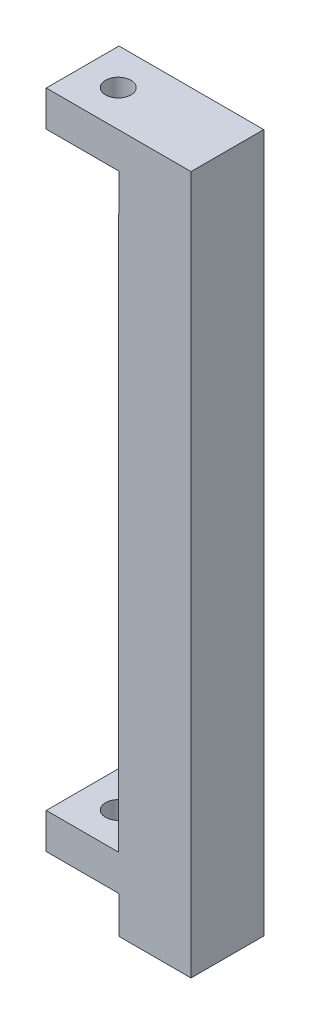
ISO-10303-21;
HEADER;
FILE_DESCRIPTION(('STEP AP214'),'2;1');
FILE_NAME('part.step','',(''),(''),'','','');
FILE_SCHEMA(('AUTOMOTIVE_DESIGN { 1 0 10303 214 1 1 1 1 }'));
ENDSEC;
DATA;
#1=APPLICATION_CONTEXT('core data for automotive mechanical design processes');
#2=APPLICATION_PROTOCOL_DEFINITION('international standard','automotive_design',2000,#1);
#3=PRODUCT_CONTEXT('',#1,'mechanical');
#4=PRODUCT('Part','Part','',(#3));
#5=PRODUCT_RELATED_PRODUCT_CATEGORY('part','',(#4));
#6=PRODUCT_DEFINITION_FORMATION('','',#4);
#7=PRODUCT_DEFINITION_CONTEXT('part definition',#1,'design');
#8=PRODUCT_DEFINITION('design','',#6,#7);
#9=PRODUCT_DEFINITION_SHAPE('','',#8);
#10=(LENGTH_UNIT() NAMED_UNIT(*) SI_UNIT(.MILLI.,.METRE.));
#11=(NAMED_UNIT(*) PLANE_ANGLE_UNIT() SI_UNIT($,.RADIAN.));
#12=(NAMED_UNIT(*) SI_UNIT($,.STERADIAN.) SOLID_ANGLE_UNIT());
#13=UNCERTAINTY_MEASURE_WITH_UNIT(LENGTH_MEASURE(1.E-05),#10,'distance_accuracy_value','');
#14=(GEOMETRIC_REPRESENTATION_CONTEXT(3) GLOBAL_UNCERTAINTY_ASSIGNED_CONTEXT((#13)) GLOBAL_UNIT_ASSIGNED_CONTEXT((#10,
#11,#12)) REPRESENTATION_CONTEXT('',''));
#15=CARTESIAN_POINT('',(0.,0.,0.));
#16=DIRECTION('',(0.,0.,1.));
#17=DIRECTION('',(1.,0.,0.));
#18=AXIS2_PLACEMENT_3D('',#15,#16,#17);
#19=CARTESIAN_POINT('',(10.,0.,-10.));
#20=DIRECTION('',(0.,-1.,0.));
#21=DIRECTION('',(0.,0.,-1.));
#22=AXIS2_PLACEMENT_3D('',#19,#20,#21);
#23=PLANE('',#22);
#24=DIRECTION('',(0.,0.,1.));
#25=VECTOR('',#24,1.);
#26=CARTESIAN_POINT('',(0.1,0.,-10.));
#27=LINE('',#26,#25);
#28=CARTESIAN_POINT('',(0.1,0.,-10.));
#29=VERTEX_POINT('',#28);
#30=CARTESIAN_POINT('',(0.0999999999999994,0.,0.));
#31=VERTEX_POINT('',#30);
#32=EDGE_CURVE('E64',#29,#31,#27,.T.);
#33=ORIENTED_EDGE('',*,*,#32,.F.);
#34=DIRECTION('',(1.,0.,0.));
#35=VECTOR('',#34,1.);
#36=CARTESIAN_POINT('',(10.,0.,-10.));
#37=LINE('',#36,#35);
#38=CARTESIAN_POINT('',(10.,0.,-10.));
#39=VERTEX_POINT('',#38);
#40=EDGE_CURVE('E144',#29,#39,#37,.T.);
#41=ORIENTED_EDGE('',*,*,#40,.T.);
#42=DIRECTION('',(0.,0.,1.));
#43=VECTOR('',#42,1.);
#44=CARTESIAN_POINT('',(10.,0.,-10.));
#45=LINE('',#44,#43);
#46=CARTESIAN_POINT('',(10.,0.,0.));
#47=VERTEX_POINT('',#46);
#48=EDGE_CURVE('E42',#39,#47,#45,.T.);
#49=ORIENTED_EDGE('',*,*,#48,.T.);
#50=DIRECTION('',(1.,0.,0.));
#51=VECTOR('',#50,1.);
#52=CARTESIAN_POINT('',(10.,0.,0.));
#53=LINE('',#52,#51);
#54=EDGE_CURVE('E146',#31,#47,#53,.T.);
#55=ORIENTED_EDGE('',*,*,#54,.F.);
#56=EDGE_LOOP('',(#33,#41,#49,#55));
#57=FACE_BOUND('',#56,.T.);
#58=ADVANCED_FACE('F39',(#57),#23,.T.);
#59=CARTESIAN_POINT('',(-10.,10.,-10.));
#60=DIRECTION('',(0.,1.,0.));
#61=DIRECTION('',(0.,0.,1.));
#62=AXIS2_PLACEMENT_3D('',#59,#60,#61);
#63=PLANE('',#62);
#64=CARTESIAN_POINT('',(-5.,9.99999999999999,-5.));
#65=DIRECTION('',(0.,1.,0.));
#66=DIRECTION('',(0.,0.,1.));
#67=AXIS2_PLACEMENT_3D('',#64,#65,#66);
#68=CIRCLE('',#67,1.75);
#69=CARTESIAN_POINT('',(-5.,9.99999999999999,-3.25));
#70=VERTEX_POINT('',#69);
#71=EDGE_CURVE('E248',#70,#70,#68,.T.);
#72=ORIENTED_EDGE('',*,*,#71,.F.);
#73=EDGE_LOOP('',(#72));
#74=FACE_BOUND('',#73,.T.);
#75=DIRECTION('',(0.,0.,1.));
#76=VECTOR('',#75,1.);
#77=CARTESIAN_POINT('',(-9.9,10.,-10.));
#78=LINE('',#77,#76);
#79=CARTESIAN_POINT('',(-9.9,10.,-10.));
#80=VERTEX_POINT('',#79);
#81=CARTESIAN_POINT('',(-9.9,10.,0.));
#82=VERTEX_POINT('',#81);
#83=EDGE_CURVE('E182',#80,#82,#78,.T.);
#84=ORIENTED_EDGE('',*,*,#83,.T.);
#85=DIRECTION('',(-1.,0.,0.));
#86=VECTOR('',#85,1.);
#87=CARTESIAN_POINT('',(-10.,10.,0.));
#88=LINE('',#87,#86);
#89=CARTESIAN_POINT('',(0.,10.,0.));
#90=VERTEX_POINT('',#89);
#91=EDGE_CURVE('E157',#90,#82,#88,.T.);
#92=ORIENTED_EDGE('',*,*,#91,.F.);
#93=DIRECTION('',(0.,0.,1.));
#94=VECTOR('',#93,1.);
#95=CARTESIAN_POINT('',(0.,10.,-10.));
#96=LINE('',#95,#94);
#97=CARTESIAN_POINT('',(0.,10.,-10.));
#98=VERTEX_POINT('',#97);
#99=EDGE_CURVE('E11',#98,#90,#96,.T.);
#100=ORIENTED_EDGE('',*,*,#99,.F.);
#101=DIRECTION('',(-1.,0.,0.));
#102=VECTOR('',#101,1.);
#103=CARTESIAN_POINT('',(-10.,10.,-10.));
#104=LINE('',#103,#102);
#105=EDGE_CURVE('E175',#98,#80,#104,.T.);
#106=ORIENTED_EDGE('',*,*,#105,.T.);
#107=EDGE_LOOP('',(#84,#92,#100,#106));
#108=FACE_BOUND('',#107,.T.);
#109=ADVANCED_FACE('F292',(#74,#108),#63,.T.);
#110=CARTESIAN_POINT('',(0.,10.,-10.));
#111=DIRECTION('',(-1.,0.,0.));
#112=DIRECTION('',(0.,0.,1.));
#113=AXIS2_PLACEMENT_3D('',#110,#111,#112);
#114=PLANE('',#113);
#115=DIRECTION('',(0.,0.,1.));
#116=VECTOR('',#115,1.);
#117=CARTESIAN_POINT('',(0.,85.9,-10.));
#118=LINE('',#117,#116);
#119=CARTESIAN_POINT('',(0.,85.9,-10.));
#120=VERTEX_POINT('',#119);
#121=CARTESIAN_POINT('',(0.,85.9,0.));
#122=VERTEX_POINT('',#121);
#123=EDGE_CURVE('E56',#120,#122,#118,.T.);
#124=ORIENTED_EDGE('',*,*,#123,.F.);
#125=DIRECTION('',(0.,-1.,0.));
#126=VECTOR('',#125,1.);
#127=CARTESIAN_POINT('',(0.,10.,-10.));
#128=LINE('',#127,#126);
#129=EDGE_CURVE('E172',#120,#98,#128,.T.);
#130=ORIENTED_EDGE('',*,*,#129,.T.);
#131=ORIENTED_EDGE('',*,*,#99,.T.);
#132=DIRECTION('',(0.,-1.,0.));
#133=VECTOR('',#132,1.);
#134=CARTESIAN_POINT('',(0.,10.,0.));
#135=LINE('',#134,#133);
#136=EDGE_CURVE('E164',#122,#90,#135,.T.);
#137=ORIENTED_EDGE('',*,*,#136,.F.);
#138=EDGE_LOOP('',(#124,#130,#131,#137));
#139=FACE_BOUND('',#138,.T.);
#140=ADVANCED_FACE('F296',(#139),#114,.T.);
#141=CARTESIAN_POINT('',(-10.,96.,-10.));
#142=DIRECTION('',(0.,1.,0.));
#143=DIRECTION('',(0.,0.,1.));
#144=AXIS2_PLACEMENT_3D('',#141,#142,#143);
#145=PLANE('',#144);
#146=CARTESIAN_POINT('',(-5.,96.,-5.));
#147=DIRECTION('',(0.,-1.,0.));
#148=DIRECTION('',(0.,0.,-1.));
#149=AXIS2_PLACEMENT_3D('',#146,#147,#148);
#150=CIRCLE('',#149,1.75);
#151=CARTESIAN_POINT('',(-5.,96.,-6.75));
#152=VERTEX_POINT('',#151);
#153=EDGE_CURVE('E274',#152,#152,#150,.T.);
#154=ORIENTED_EDGE('',*,*,#153,.T.);
#155=EDGE_LOOP('',(#154));
#156=FACE_BOUND('',#155,.T.);
#157=DIRECTION('',(0.,0.,1.));
#158=VECTOR('',#157,1.);
#159=CARTESIAN_POINT('',(-9.90000000000001,96.,-10.));
#160=LINE('',#159,#158);
#161=CARTESIAN_POINT('',(-9.90000000000001,96.,-10.));
#162=VERTEX_POINT('',#161);
#163=CARTESIAN_POINT('',(-9.90000000000001,96.,0.));
#164=VERTEX_POINT('',#163);
#165=EDGE_CURVE('E206',#162,#164,#160,.T.);
#166=ORIENTED_EDGE('',*,*,#165,.T.);
#167=DIRECTION('',(-1.,0.,0.));
#168=VECTOR('',#167,1.);
#169=CARTESIAN_POINT('',(-10.,96.,0.));
#170=LINE('',#169,#168);
#171=CARTESIAN_POINT('',(9.99999999999999,96.,0.));
#172=VERTEX_POINT('',#171);
#173=EDGE_CURVE('E186',#172,#164,#170,.T.);
#174=ORIENTED_EDGE('',*,*,#173,.F.);
#175=DIRECTION('',(0.,0.,1.));
#176=VECTOR('',#175,1.);
#177=CARTESIAN_POINT('',(9.99999999999999,96.,-10.));
#178=LINE('',#177,#176);
#179=CARTESIAN_POINT('',(9.99999999999999,96.,-10.));
#180=VERTEX_POINT('',#179);
#181=EDGE_CURVE('E48',#180,#172,#178,.T.);
#182=ORIENTED_EDGE('',*,*,#181,.F.);
#183=DIRECTION('',(-1.,0.,0.));
#184=VECTOR('',#183,1.);
#185=CARTESIAN_POINT('',(-10.,96.,-10.));
#186=LINE('',#185,#184);
#187=EDGE_CURVE('E161',#180,#162,#186,.T.);
#188=ORIENTED_EDGE('',*,*,#187,.T.);
#189=EDGE_LOOP('',(#166,#174,#182,#188));
#190=FACE_BOUND('',#189,.T.);
#191=ADVANCED_FACE('F307',(#156,#190),#145,.T.);
#192=CARTESIAN_POINT('',(9.99999999999999,96.,-10.));
#193=DIRECTION('',(1.,0.,0.));
#194=DIRECTION('',(0.,1.,0.));
#195=AXIS2_PLACEMENT_3D('',#192,#193,#194);
#196=PLANE('',#195);
#197=DIRECTION('',(0.,1.,0.));
#198=VECTOR('',#197,1.);
#199=CARTESIAN_POINT('',(9.99999999999999,96.,0.));
#200=LINE('',#199,#198);
#201=EDGE_CURVE('E181',#47,#172,#200,.T.);
#202=ORIENTED_EDGE('',*,*,#201,.F.);
#203=ORIENTED_EDGE('',*,*,#48,.F.);
#204=DIRECTION('',(0.,1.,0.));
#205=VECTOR('',#204,1.);
#206=CARTESIAN_POINT('',(9.99999999999999,96.,-10.));
#207=LINE('',#206,#205);
#208=EDGE_CURVE('E155',#39,#180,#207,.T.);
#209=ORIENTED_EDGE('',*,*,#208,.T.);
#210=ORIENTED_EDGE('',*,*,#181,.T.);
#211=EDGE_LOOP('',(#202,#203,#209,#210));
#212=FACE_BOUND('',#211,.T.);
#213=ADVANCED_FACE('F196',(#212),#196,.T.);
#214=CARTESIAN_POINT('',(0.,0.,-10.));
#215=DIRECTION('',(0.,0.,-1.));
#216=DIRECTION('',(-1.,0.,0.));
#217=AXIS2_PLACEMENT_3D('',#214,#215,#216);
#218=PLANE('',#217);
#219=DIRECTION('',(0.,1.,0.));
#220=VECTOR('',#219,1.);
#221=CARTESIAN_POINT('',(-9.9,10.,-10.));
#222=LINE('',#221,#220);
#223=CARTESIAN_POINT('',(-9.9,5.1,-10.));
#224=VERTEX_POINT('',#223);
#225=EDGE_CURVE('E148',#224,#80,#222,.T.);
#226=ORIENTED_EDGE('',*,*,#225,.T.);
#227=ORIENTED_EDGE('',*,*,#105,.F.);
#228=ORIENTED_EDGE('',*,*,#129,.F.);
#229=DIRECTION('',(1.,0.,0.));
#230=VECTOR('',#229,1.);
#231=CARTESIAN_POINT('',(0.,85.9,-10.));
#232=LINE('',#231,#230);
#233=CARTESIAN_POINT('',(0.100000000000001,85.9,-10.));
#234=VERTEX_POINT('',#233);
#235=EDGE_CURVE('E227',#120,#234,#232,.T.);
#236=ORIENTED_EDGE('',*,*,#235,.T.);
#237=DIRECTION('',(0.,1.,0.));
#238=VECTOR('',#237,1.);
#239=CARTESIAN_POINT('',(0.100000000000001,91.1,-10.));
#240=LINE('',#239,#238);
#241=CARTESIAN_POINT('',(0.100000000000001,91.1,-10.));
#242=VERTEX_POINT('',#241);
#243=EDGE_CURVE('E231',#234,#242,#240,.T.);
#244=ORIENTED_EDGE('',*,*,#243,.T.);
#245=DIRECTION('',(-1.,0.,0.));
#246=VECTOR('',#245,1.);
#247=CARTESIAN_POINT('',(-9.90000000000001,91.1,-10.));
#248=LINE('',#247,#246);
#249=CARTESIAN_POINT('',(-9.90000000000001,91.1,-10.));
#250=VERTEX_POINT('',#249);
#251=EDGE_CURVE('E236',#242,#250,#248,.T.);
#252=ORIENTED_EDGE('',*,*,#251,.T.);
#253=DIRECTION('',(0.,1.,0.));
#254=VECTOR('',#253,1.);
#255=CARTESIAN_POINT('',(-9.90000000000001,96.,-10.));
#256=LINE('',#255,#254);
#257=EDGE_CURVE('E240',#250,#162,#256,.T.);
#258=ORIENTED_EDGE('',*,*,#257,.T.);
#259=ORIENTED_EDGE('',*,*,#187,.F.);
#260=ORIENTED_EDGE('',*,*,#208,.F.);
#261=ORIENTED_EDGE('',*,*,#40,.F.);
#262=DIRECTION('',(0.,1.,0.));
#263=VECTOR('',#262,1.);
#264=CARTESIAN_POINT('',(0.1,5.1,-10.));
#265=LINE('',#264,#263);
#266=CARTESIAN_POINT('',(0.1,5.1,-10.));
#267=VERTEX_POINT('',#266);
#268=EDGE_CURVE('E130',#29,#267,#265,.T.);
#269=ORIENTED_EDGE('',*,*,#268,.T.);
#270=DIRECTION('',(-1.,0.,0.));
#271=VECTOR('',#270,1.);
#272=CARTESIAN_POINT('',(-9.9,5.1,-10.));
#273=LINE('',#272,#271);
#274=EDGE_CURVE('E138',#267,#224,#273,.T.);
#275=ORIENTED_EDGE('',*,*,#274,.T.);
#276=EDGE_LOOP('',(#226,#227,#228,#236,#244,#252,#258,#259,#260,#261,#269,#275));
#277=FACE_BOUND('',#276,.T.);
#278=ADVANCED_FACE('F152',(#277),#218,.T.);
#279=CARTESIAN_POINT('',(0.,0.,0.));
#280=DIRECTION('',(0.,0.,-1.));
#281=DIRECTION('',(-1.,0.,0.));
#282=AXIS2_PLACEMENT_3D('',#279,#280,#281);
#283=PLANE('',#282);
#284=ORIENTED_EDGE('',*,*,#91,.T.);
#285=DIRECTION('',(0.,1.,0.));
#286=VECTOR('',#285,1.);
#287=CARTESIAN_POINT('',(-9.9,10.,0.));
#288=LINE('',#287,#286);
#289=CARTESIAN_POINT('',(-9.9,5.1,0.));
#290=VERTEX_POINT('',#289);
#291=EDGE_CURVE('E139',#290,#82,#288,.T.);
#292=ORIENTED_EDGE('',*,*,#291,.F.);
#293=DIRECTION('',(-1.,0.,0.));
#294=VECTOR('',#293,1.);
#295=CARTESIAN_POINT('',(-9.9,5.1,0.));
#296=LINE('',#295,#294);
#297=CARTESIAN_POINT('',(0.1,5.1,0.));
#298=VERTEX_POINT('',#297);
#299=EDGE_CURVE('E204',#298,#290,#296,.T.);
#300=ORIENTED_EDGE('',*,*,#299,.F.);
#301=DIRECTION('',(0.,1.,0.));
#302=VECTOR('',#301,1.);
#303=CARTESIAN_POINT('',(0.1,5.1,0.));
#304=LINE('',#303,#302);
#305=EDGE_CURVE('E201',#31,#298,#304,.T.);
#306=ORIENTED_EDGE('',*,*,#305,.F.);
#307=ORIENTED_EDGE('',*,*,#54,.T.);
#308=ORIENTED_EDGE('',*,*,#201,.T.);
#309=ORIENTED_EDGE('',*,*,#173,.T.);
#310=DIRECTION('',(0.,1.,0.));
#311=VECTOR('',#310,1.);
#312=CARTESIAN_POINT('',(-9.90000000000001,96.,0.));
#313=LINE('',#312,#311);
#314=CARTESIAN_POINT('',(-9.90000000000001,91.1,0.));
#315=VERTEX_POINT('',#314);
#316=EDGE_CURVE('E232',#315,#164,#313,.T.);
#317=ORIENTED_EDGE('',*,*,#316,.F.);
#318=DIRECTION('',(-1.,0.,0.));
#319=VECTOR('',#318,1.);
#320=CARTESIAN_POINT('',(-9.90000000000001,91.1,0.));
#321=LINE('',#320,#319);
#322=CARTESIAN_POINT('',(0.100000000000001,91.1,0.));
#323=VERTEX_POINT('',#322);
#324=EDGE_CURVE('E252',#323,#315,#321,.T.);
#325=ORIENTED_EDGE('',*,*,#324,.F.);
#326=DIRECTION('',(0.,1.,0.));
#327=VECTOR('',#326,1.);
#328=CARTESIAN_POINT('',(0.100000000000001,91.1,0.));
#329=LINE('',#328,#327);
#330=CARTESIAN_POINT('',(0.100000000000001,85.9,0.));
#331=VERTEX_POINT('',#330);
#332=EDGE_CURVE('E247',#331,#323,#329,.T.);
#333=ORIENTED_EDGE('',*,*,#332,.F.);
#334=DIRECTION('',(1.,0.,0.));
#335=VECTOR('',#334,1.);
#336=CARTESIAN_POINT('',(0.,85.9,0.));
#337=LINE('',#336,#335);
#338=EDGE_CURVE('E244',#122,#331,#337,.T.);
#339=ORIENTED_EDGE('',*,*,#338,.F.);
#340=ORIENTED_EDGE('',*,*,#136,.T.);
#341=EDGE_LOOP('',(#284,#292,#300,#306,#307,#308,#309,#317,#325,#333,#339,#340));
#342=FACE_BOUND('',#341,.T.);
#343=ADVANCED_FACE('F198',(#342),#283,.F.);
#344=CARTESIAN_POINT('',(-9.90000000000001,96.,-10.));
#345=DIRECTION('',(1.,0.,0.));
#346=DIRECTION('',(0.,1.,0.));
#347=AXIS2_PLACEMENT_3D('',#344,#345,#346);
#348=PLANE('',#347);
#349=ORIENTED_EDGE('',*,*,#316,.T.);
#350=ORIENTED_EDGE('',*,*,#165,.F.);
#351=ORIENTED_EDGE('',*,*,#257,.F.);
#352=DIRECTION('',(0.,0.,1.));
#353=VECTOR('',#352,1.);
#354=CARTESIAN_POINT('',(-9.90000000000001,91.1,-10.));
#355=LINE('',#354,#353);
#356=EDGE_CURVE('E212',#250,#315,#355,.T.);
#357=ORIENTED_EDGE('',*,*,#356,.T.);
#358=EDGE_LOOP('',(#349,#350,#351,#357));
#359=FACE_BOUND('',#358,.T.);
#360=ADVANCED_FACE('F308',(#359),#348,.F.);
#361=CARTESIAN_POINT('',(-9.90000000000001,91.1,-10.));
#362=DIRECTION('',(0.,1.,0.));
#363=DIRECTION('',(0.,0.,1.));
#364=AXIS2_PLACEMENT_3D('',#361,#362,#363);
#365=PLANE('',#364);
#366=CARTESIAN_POINT('',(-5.,91.1,-5.));
#367=DIRECTION('',(0.,1.,0.));
#368=DIRECTION('',(0.,0.,1.));
#369=AXIS2_PLACEMENT_3D('',#366,#367,#368);
#370=CIRCLE('',#369,1.75);
#371=CARTESIAN_POINT('',(-5.,91.1,-3.25));
#372=VERTEX_POINT('',#371);
#373=EDGE_CURVE('E270',#372,#372,#370,.T.);
#374=ORIENTED_EDGE('',*,*,#373,.T.);
#375=EDGE_LOOP('',(#374));
#376=FACE_BOUND('',#375,.T.);
#377=ORIENTED_EDGE('',*,*,#324,.T.);
#378=ORIENTED_EDGE('',*,*,#356,.F.);
#379=ORIENTED_EDGE('',*,*,#251,.F.);
#380=DIRECTION('',(0.,0.,1.));
#381=VECTOR('',#380,1.);
#382=CARTESIAN_POINT('',(0.100000000000001,91.1,-10.));
#383=LINE('',#382,#381);
#384=EDGE_CURVE('E260',#242,#323,#383,.T.);
#385=ORIENTED_EDGE('',*,*,#384,.T.);
#386=EDGE_LOOP('',(#377,#378,#379,#385));
#387=FACE_BOUND('',#386,.T.);
#388=ADVANCED_FACE('F303',(#376,#387),#365,.F.);
#389=CARTESIAN_POINT('',(0.100000000000001,91.1,-10.));
#390=DIRECTION('',(1.,0.,0.));
#391=DIRECTION('',(0.,1.,0.));
#392=AXIS2_PLACEMENT_3D('',#389,#390,#391);
#393=PLANE('',#392);
#394=ORIENTED_EDGE('',*,*,#332,.T.);
#395=ORIENTED_EDGE('',*,*,#384,.F.);
#396=ORIENTED_EDGE('',*,*,#243,.F.);
#397=DIRECTION('',(0.,0.,1.));
#398=VECTOR('',#397,1.);
#399=CARTESIAN_POINT('',(0.100000000000001,85.9,-10.));
#400=LINE('',#399,#398);
#401=EDGE_CURVE('E262',#234,#331,#400,.T.);
#402=ORIENTED_EDGE('',*,*,#401,.T.);
#403=EDGE_LOOP('',(#394,#395,#396,#402));
#404=FACE_BOUND('',#403,.T.);
#405=ADVANCED_FACE('F299',(#404),#393,.F.);
#406=CARTESIAN_POINT('',(0.,85.9,-10.));
#407=DIRECTION('',(0.,-1.,0.));
#408=DIRECTION('',(0.,0.,-1.));
#409=AXIS2_PLACEMENT_3D('',#406,#407,#408);
#410=PLANE('',#409);
#411=ORIENTED_EDGE('',*,*,#338,.T.);
#412=ORIENTED_EDGE('',*,*,#401,.F.);
#413=ORIENTED_EDGE('',*,*,#235,.F.);
#414=ORIENTED_EDGE('',*,*,#123,.T.);
#415=EDGE_LOOP('',(#411,#412,#413,#414));
#416=FACE_BOUND('',#415,.T.);
#417=ADVANCED_FACE('F297',(#416),#410,.F.);
#418=CARTESIAN_POINT('',(-9.9,10.,-10.));
#419=DIRECTION('',(1.,0.,0.));
#420=DIRECTION('',(0.,0.,-1.));
#421=AXIS2_PLACEMENT_3D('',#418,#419,#420);
#422=PLANE('',#421);
#423=ORIENTED_EDGE('',*,*,#291,.T.);
#424=ORIENTED_EDGE('',*,*,#83,.F.);
#425=ORIENTED_EDGE('',*,*,#225,.F.);
#426=DIRECTION('',(0.,0.,1.));
#427=VECTOR('',#426,1.);
#428=CARTESIAN_POINT('',(-9.9,5.1,-10.));
#429=LINE('',#428,#427);
#430=EDGE_CURVE('E222',#224,#290,#429,.T.);
#431=ORIENTED_EDGE('',*,*,#430,.T.);
#432=EDGE_LOOP('',(#423,#424,#425,#431));
#433=FACE_BOUND('',#432,.T.);
#434=ADVANCED_FACE('F309',(#433),#422,.F.);
#435=CARTESIAN_POINT('',(-9.9,5.1,-10.));
#436=DIRECTION('',(0.,1.,0.));
#437=DIRECTION('',(0.,0.,1.));
#438=AXIS2_PLACEMENT_3D('',#435,#436,#437);
#439=PLANE('',#438);
#440=CARTESIAN_POINT('',(-5.,5.1,-5.));
#441=DIRECTION('',(0.,-1.,0.));
#442=DIRECTION('',(0.,0.,-1.));
#443=AXIS2_PLACEMENT_3D('',#440,#441,#442);
#444=CIRCLE('',#443,1.75);
#445=CARTESIAN_POINT('',(-5.,5.1,-6.75));
#446=VERTEX_POINT('',#445);
#447=EDGE_CURVE('E278',#446,#446,#444,.T.);
#448=ORIENTED_EDGE('',*,*,#447,.F.);
#449=EDGE_LOOP('',(#448));
#450=FACE_BOUND('',#449,.T.);
#451=ORIENTED_EDGE('',*,*,#299,.T.);
#452=ORIENTED_EDGE('',*,*,#430,.F.);
#453=ORIENTED_EDGE('',*,*,#274,.F.);
#454=DIRECTION('',(0.,0.,1.));
#455=VECTOR('',#454,1.);
#456=CARTESIAN_POINT('',(0.1,5.1,-10.));
#457=LINE('',#456,#455);
#458=EDGE_CURVE('E132',#267,#298,#457,.T.);
#459=ORIENTED_EDGE('',*,*,#458,.T.);
#460=EDGE_LOOP('',(#451,#452,#453,#459));
#461=FACE_BOUND('',#460,.T.);
#462=ADVANCED_FACE('F311',(#450,#461),#439,.F.);
#463=CARTESIAN_POINT('',(0.1,5.1,-10.));
#464=DIRECTION('',(1.,0.,0.));
#465=DIRECTION('',(0.,0.,-1.));
#466=AXIS2_PLACEMENT_3D('',#463,#464,#465);
#467=PLANE('',#466);
#468=ORIENTED_EDGE('',*,*,#305,.T.);
#469=ORIENTED_EDGE('',*,*,#458,.F.);
#470=ORIENTED_EDGE('',*,*,#268,.F.);
#471=ORIENTED_EDGE('',*,*,#32,.T.);
#472=EDGE_LOOP('',(#468,#469,#470,#471));
#473=FACE_BOUND('',#472,.T.);
#474=ADVANCED_FACE('F131',(#473),#467,.F.);
#475=CARTESIAN_POINT('',(-5.,96.,-5.));
#476=DIRECTION('',(0.,-1.,0.));
#477=DIRECTION('',(0.,0.,-1.));
#478=AXIS2_PLACEMENT_3D('',#475,#476,#477);
#479=CYLINDRICAL_SURFACE('',#478,1.75);
#480=ORIENTED_EDGE('',*,*,#71,.T.);
#481=EDGE_LOOP('',(#480));
#482=FACE_BOUND('',#481,.T.);
#483=ORIENTED_EDGE('',*,*,#447,.T.);
#484=EDGE_LOOP('',(#483));
#485=FACE_BOUND('',#484,.T.);
#486=ADVANCED_FACE('F319',(#482,#485),#479,.F.);
#487=ORIENTED_EDGE('',*,*,#153,.F.);
#488=EDGE_LOOP('',(#487));
#489=FACE_BOUND('',#488,.T.);
#490=ORIENTED_EDGE('',*,*,#373,.F.);
#491=EDGE_LOOP('',(#490));
#492=FACE_BOUND('',#491,.T.);
#493=ADVANCED_FACE('F430',(#489,#492),#479,.F.);
#494=CLOSED_SHELL('',(#58,#109,#140,#191,#213,#278,#343,#360,#388,#405,#417,#434,#462,#474,#486,#493));
#495=MANIFOLD_SOLID_BREP('B2',#494);
#496=ADVANCED_BREP_SHAPE_REPRESENTATION('',(#18,#495),#14);
#497=SHAPE_DEFINITION_REPRESENTATION(#9,#496);
ENDSEC;
END-ISO-10303-21;
